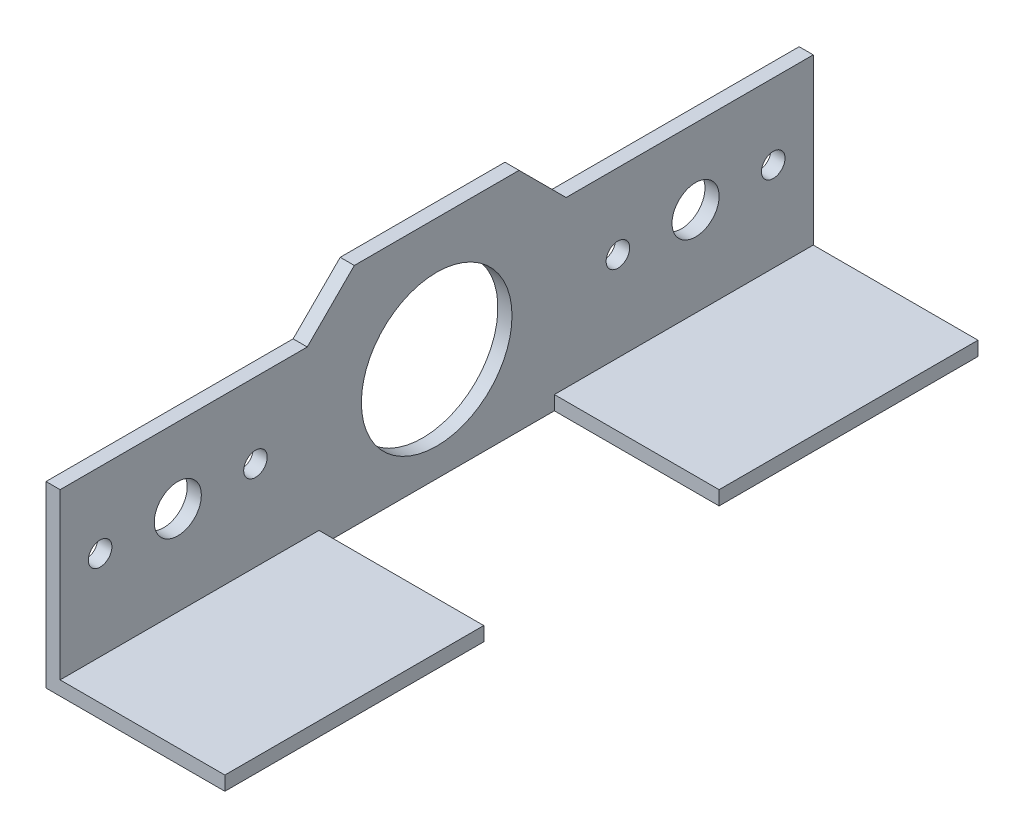
ISO-10303-21;
HEADER;
FILE_DESCRIPTION(('STEP AP214'),'2;1');
FILE_NAME('part.step','',(''),(''),'','','');
FILE_SCHEMA(('AUTOMOTIVE_DESIGN { 1 0 10303 214 1 1 1 1 }'));
ENDSEC;
DATA;
#1=APPLICATION_CONTEXT('core data for automotive mechanical design processes');
#2=APPLICATION_PROTOCOL_DEFINITION('international standard','automotive_design',2000,#1);
#3=PRODUCT_CONTEXT('',#1,'mechanical');
#4=PRODUCT('Part','Part','',(#3));
#5=PRODUCT_RELATED_PRODUCT_CATEGORY('part','',(#4));
#6=PRODUCT_DEFINITION_FORMATION('','',#4);
#7=PRODUCT_DEFINITION_CONTEXT('part definition',#1,'design');
#8=PRODUCT_DEFINITION('design','',#6,#7);
#9=PRODUCT_DEFINITION_SHAPE('','',#8);
#10=(LENGTH_UNIT() NAMED_UNIT(*) SI_UNIT(.MILLI.,.METRE.));
#11=(NAMED_UNIT(*) PLANE_ANGLE_UNIT() SI_UNIT($,.RADIAN.));
#12=(NAMED_UNIT(*) SI_UNIT($,.STERADIAN.) SOLID_ANGLE_UNIT());
#13=UNCERTAINTY_MEASURE_WITH_UNIT(LENGTH_MEASURE(1.E-05),#10,'distance_accuracy_value','');
#14=(GEOMETRIC_REPRESENTATION_CONTEXT(3) GLOBAL_UNCERTAINTY_ASSIGNED_CONTEXT((#13)) GLOBAL_UNIT_ASSIGNED_CONTEXT((#10,
#11,#12)) REPRESENTATION_CONTEXT('',''));
#15=CARTESIAN_POINT('',(0.,0.,0.));
#16=DIRECTION('',(0.,0.,1.));
#17=DIRECTION('',(1.,0.,0.));
#18=AXIS2_PLACEMENT_3D('',#15,#16,#17);
#19=CARTESIAN_POINT('',(0.,38.0000000000002,-80.));
#20=DIRECTION('',(0.,1.00000000000001,0.));
#21=DIRECTION('',(0.,0.,1.));
#22=AXIS2_PLACEMENT_3D('',#19,#20,#21);
#23=PLANE('',#22);
#24=DIRECTION('',(0.,0.,1.));
#25=VECTOR('',#24,1.);
#26=CARTESIAN_POINT('',(3.,38.0000000000002,-79.9999999999999));
#27=LINE('',#26,#25);
#28=CARTESIAN_POINT('',(2.99999999999878,38.0000000000002,27.4999999999995));
#29=VERTEX_POINT('',#28);
#30=CARTESIAN_POINT('',(2.99999999999989,38.0000000000002,80.));
#31=VERTEX_POINT('',#30);
#32=EDGE_CURVE('E276',#29,#31,#27,.T.);
#33=ORIENTED_EDGE('',*,*,#32,.F.);
#34=DIRECTION('',(-1.00000000000001,0.,0.));
#35=VECTOR('',#34,1.);
#36=CARTESIAN_POINT('',(58.9016994374935,38.0000000000002,27.4999999999995));
#37=LINE('',#36,#35);
#38=CARTESIAN_POINT('',(-1.33226762955019E-12,38.0000000000002,27.4999999999998));
#39=VERTEX_POINT('',#38);
#40=EDGE_CURVE('E163',#29,#39,#37,.T.);
#41=ORIENTED_EDGE('',*,*,#40,.T.);
#42=DIRECTION('',(0.,0.,1.));
#43=VECTOR('',#42,1.);
#44=CARTESIAN_POINT('',(0.,38.0000000000002,-80.));
#45=LINE('',#44,#43);
#46=CARTESIAN_POINT('',(0.,38.0000000000002,80.));
#47=VERTEX_POINT('',#46);
#48=EDGE_CURVE('E273',#39,#47,#45,.T.);
#49=ORIENTED_EDGE('',*,*,#48,.T.);
#50=DIRECTION('',(-1.00000000000001,0.,0.));
#51=VECTOR('',#50,1.);
#52=CARTESIAN_POINT('',(0.,38.0000000000002,80.));
#53=LINE('',#52,#51);
#54=EDGE_CURVE('E246',#31,#47,#53,.T.);
#55=ORIENTED_EDGE('',*,*,#54,.F.);
#56=EDGE_LOOP('',(#33,#41,#49,#55));
#57=FACE_BOUND('',#56,.T.);
#58=ADVANCED_FACE('F42',(#57),#23,.T.);
#59=CARTESIAN_POINT('',(3.,3.,-80.));
#60=DIRECTION('',(0.,1.00000000000001,0.));
#61=DIRECTION('',(0.,0.,1.));
#62=AXIS2_PLACEMENT_3D('',#59,#60,#61);
#63=PLANE('',#62);
#64=DIRECTION('',(1.00000000000001,0.,0.));
#65=VECTOR('',#64,1.);
#66=CARTESIAN_POINT('',(2.99999999999878,3.,25.));
#67=LINE('',#66,#65);
#68=CARTESIAN_POINT('',(2.99999999999878,3.,25.));
#69=VERTEX_POINT('',#68);
#70=CARTESIAN_POINT('',(37.9999999999997,3.,24.9999999999997));
#71=VERTEX_POINT('',#70);
#72=EDGE_CURVE('E214',#69,#71,#67,.T.);
#73=ORIENTED_EDGE('',*,*,#72,.F.);
#74=DIRECTION('',(0.,0.,1.));
#75=VECTOR('',#74,1.);
#76=CARTESIAN_POINT('',(3.,3.,-80.));
#77=LINE('',#76,#75);
#78=CARTESIAN_POINT('',(2.99999999999989,3.,80.));
#79=VERTEX_POINT('',#78);
#80=EDGE_CURVE('E279',#69,#79,#77,.T.);
#81=ORIENTED_EDGE('',*,*,#80,.T.);
#82=DIRECTION('',(-1.00000000000001,0.,0.));
#83=VECTOR('',#82,1.);
#84=CARTESIAN_POINT('',(2.99999999999989,3.,80.));
#85=LINE('',#84,#83);
#86=CARTESIAN_POINT('',(37.9999999999999,3.,80.));
#87=VERTEX_POINT('',#86);
#88=EDGE_CURVE('E240',#87,#79,#85,.T.);
#89=ORIENTED_EDGE('',*,*,#88,.F.);
#90=DIRECTION('',(0.,0.,1.));
#91=VECTOR('',#90,1.);
#92=CARTESIAN_POINT('',(38.,3.,-80.));
#93=LINE('',#92,#91);
#94=EDGE_CURVE('E282',#71,#87,#93,.T.);
#95=ORIENTED_EDGE('',*,*,#94,.F.);
#96=EDGE_LOOP('',(#73,#81,#89,#95));
#97=FACE_BOUND('',#96,.T.);
#98=ADVANCED_FACE('F360',(#97),#63,.T.);
#99=CARTESIAN_POINT('',(38.,3.,-80.));
#100=DIRECTION('',(1.00000000000001,0.,0.));
#101=DIRECTION('',(0.,0.,-1.));
#102=AXIS2_PLACEMENT_3D('',#99,#100,#101);
#103=PLANE('',#102);
#104=DIRECTION('',(0.,1.00000000000001,0.));
#105=VECTOR('',#104,1.);
#106=CARTESIAN_POINT('',(37.9999999999997,-61.0327780786688,24.9999999999997));
#107=LINE('',#106,#105);
#108=CARTESIAN_POINT('',(37.9999999999997,0.,25.));
#109=VERTEX_POINT('',#108);
#110=EDGE_CURVE('E228',#109,#71,#107,.T.);
#111=ORIENTED_EDGE('',*,*,#110,.T.);
#112=ORIENTED_EDGE('',*,*,#94,.T.);
#113=DIRECTION('',(0.,1.00000000000001,0.));
#114=VECTOR('',#113,1.);
#115=CARTESIAN_POINT('',(37.9999999999999,3.,80.));
#116=LINE('',#115,#114);
#117=CARTESIAN_POINT('',(37.9999999999999,0.,80.));
#118=VERTEX_POINT('',#117);
#119=EDGE_CURVE('E237',#118,#87,#116,.T.);
#120=ORIENTED_EDGE('',*,*,#119,.F.);
#121=DIRECTION('',(0.,0.,1.));
#122=VECTOR('',#121,1.);
#123=CARTESIAN_POINT('',(38.,0.,-80.0000000000001));
#124=LINE('',#123,#122);
#125=EDGE_CURVE('E269',#109,#118,#124,.T.);
#126=ORIENTED_EDGE('',*,*,#125,.F.);
#127=EDGE_LOOP('',(#111,#112,#120,#126));
#128=FACE_BOUND('',#127,.T.);
#129=ADVANCED_FACE('F291',(#128),#103,.T.);
#130=CARTESIAN_POINT('',(0.,0.,-80.0000000000006));
#131=DIRECTION('',(0.,-1.00000000000001,0.));
#132=DIRECTION('',(0.,0.,-1.));
#133=AXIS2_PLACEMENT_3D('',#130,#131,#132);
#134=PLANE('',#133);
#135=DIRECTION('',(1.00000000000001,0.,0.));
#136=VECTOR('',#135,1.);
#137=CARTESIAN_POINT('',(2.99999999999878,0.,25.));
#138=LINE('',#137,#136);
#139=CARTESIAN_POINT('',(2.99999999999878,0.,25.));
#140=VERTEX_POINT('',#139);
#141=EDGE_CURVE('E225',#140,#109,#138,.T.);
#142=ORIENTED_EDGE('',*,*,#141,.T.);
#143=ORIENTED_EDGE('',*,*,#125,.T.);
#144=DIRECTION('',(1.00000000000001,0.,0.));
#145=VECTOR('',#144,1.);
#146=CARTESIAN_POINT('',(0.,0.,80.));
#147=LINE('',#146,#145);
#148=CARTESIAN_POINT('',(0.,0.,80.));
#149=VERTEX_POINT('',#148);
#150=EDGE_CURVE('E234',#149,#118,#147,.T.);
#151=ORIENTED_EDGE('',*,*,#150,.F.);
#152=DIRECTION('',(0.,0.,1.));
#153=VECTOR('',#152,1.);
#154=CARTESIAN_POINT('',(0.,0.,-80.0000000000006));
#155=LINE('',#154,#153);
#156=CARTESIAN_POINT('',(0.,0.,-80.0000000000006));
#157=VERTEX_POINT('',#156);
#158=EDGE_CURVE('E11',#157,#149,#155,.T.);
#159=ORIENTED_EDGE('',*,*,#158,.F.);
#160=DIRECTION('',(1.00000000000001,0.,0.));
#161=VECTOR('',#160,1.);
#162=CARTESIAN_POINT('',(0.,0.,-80.0000000000006));
#163=LINE('',#162,#161);
#164=CARTESIAN_POINT('',(38.,0.,-80.0000000000001));
#165=VERTEX_POINT('',#164);
#166=EDGE_CURVE('E252',#157,#165,#163,.T.);
#167=ORIENTED_EDGE('',*,*,#166,.T.);
#168=CARTESIAN_POINT('',(37.9999999999998,0.,-25.));
#169=VERTEX_POINT('',#168);
#170=EDGE_CURVE('E46',#165,#169,#124,.T.);
#171=ORIENTED_EDGE('',*,*,#170,.T.);
#172=DIRECTION('',(-1.00000000000001,0.,0.));
#173=VECTOR('',#172,1.);
#174=CARTESIAN_POINT('',(2.99999999999978,0.,-25.0000000000006));
#175=LINE('',#174,#173);
#176=CARTESIAN_POINT('',(2.99999999999978,0.,-25.0000000000006));
#177=VERTEX_POINT('',#176);
#178=EDGE_CURVE('E67',#169,#177,#175,.T.);
#179=ORIENTED_EDGE('',*,*,#178,.T.);
#180=DIRECTION('',(0.,0.,1.));
#181=VECTOR('',#180,1.);
#182=CARTESIAN_POINT('',(2.99999999999978,0.,-25.0000000000006));
#183=LINE('',#182,#181);
#184=EDGE_CURVE('E216',#177,#140,#183,.T.);
#185=ORIENTED_EDGE('',*,*,#184,.T.);
#186=EDGE_LOOP('',(#142,#143,#151,#159,#167,#171,#179,#185));
#187=FACE_BOUND('',#186,.T.);
#188=ADVANCED_FACE('F44',(#187),#134,.T.);
#189=CARTESIAN_POINT('',(0.,0.,-80.0000000000006));
#190=DIRECTION('',(-1.00000000000001,0.,0.));
#191=DIRECTION('',(0.,0.,1.));
#192=AXIS2_PLACEMENT_3D('',#189,#190,#191);
#193=PLANE('',#192);
#194=CARTESIAN_POINT('',(0.,22.0000000000001,-1.94289029309402E-13));
#195=DIRECTION('',(-1.00000000000001,0.,0.));
#196=DIRECTION('',(0.,0.,1.));
#197=AXIS2_PLACEMENT_3D('',#194,#195,#196);
#198=CIRCLE('',#197,15.999999999999);
#199=CARTESIAN_POINT('',(0.,22.0000000000001,15.9999999999988));
#200=VERTEX_POINT('',#199);
#201=EDGE_CURVE('E323',#200,#200,#198,.T.);
#202=ORIENTED_EDGE('',*,*,#201,.F.);
#203=EDGE_LOOP('',(#202));
#204=FACE_BOUND('',#203,.T.);
#205=CARTESIAN_POINT('',(0.,22.0000000000001,71.4999999999998));
#206=DIRECTION('',(-1.00000000000001,0.,0.));
#207=DIRECTION('',(0.,0.,1.));
#208=AXIS2_PLACEMENT_3D('',#205,#206,#207);
#209=CIRCLE('',#208,2.49999999999937);
#210=CARTESIAN_POINT('',(0.,22.0000000000001,73.9999999999992));
#211=VERTEX_POINT('',#210);
#212=EDGE_CURVE('E178',#211,#211,#209,.T.);
#213=ORIENTED_EDGE('',*,*,#212,.F.);
#214=EDGE_LOOP('',(#213));
#215=FACE_BOUND('',#214,.T.);
#216=CARTESIAN_POINT('',(0.,22.0000000000001,54.9999999999998));
#217=DIRECTION('',(-1.00000000000001,0.,0.));
#218=DIRECTION('',(0.,0.,1.));
#219=AXIS2_PLACEMENT_3D('',#216,#217,#218);
#220=CIRCLE('',#219,4.9999999999993);
#221=CARTESIAN_POINT('',(0.,22.0000000000001,59.9999999999991));
#222=VERTEX_POINT('',#221);
#223=EDGE_CURVE('E186',#222,#222,#220,.T.);
#224=ORIENTED_EDGE('',*,*,#223,.F.);
#225=EDGE_LOOP('',(#224));
#226=FACE_BOUND('',#225,.T.);
#227=CARTESIAN_POINT('',(0.,22.0000000000001,38.4999999999998));
#228=DIRECTION('',(-1.00000000000001,0.,0.));
#229=DIRECTION('',(0.,0.,1.));
#230=AXIS2_PLACEMENT_3D('',#227,#228,#229);
#231=CIRCLE('',#230,2.4999999999992);
#232=CARTESIAN_POINT('',(0.,22.0000000000001,40.999999999999));
#233=VERTEX_POINT('',#232);
#234=EDGE_CURVE('E192',#233,#233,#231,.T.);
#235=ORIENTED_EDGE('',*,*,#234,.F.);
#236=EDGE_LOOP('',(#235));
#237=FACE_BOUND('',#236,.T.);
#238=CARTESIAN_POINT('',(-1.33226762955019E-12,22.0000000000001,-38.5000000000001));
#239=DIRECTION('',(-1.00000000000001,0.,0.));
#240=DIRECTION('',(0.,0.,1.));
#241=AXIS2_PLACEMENT_3D('',#238,#239,#240);
#242=CIRCLE('',#241,2.49999999999868);
#243=CARTESIAN_POINT('',(-1.33226762954115E-12,22.0000000000001,-36.0000000000014));
#244=VERTEX_POINT('',#243);
#245=EDGE_CURVE('E198',#244,#244,#242,.T.);
#246=ORIENTED_EDGE('',*,*,#245,.F.);
#247=EDGE_LOOP('',(#246));
#248=FACE_BOUND('',#247,.T.);
#249=CARTESIAN_POINT('',(-1.33226762955019E-12,22.0000000000001,-55.0000000000001));
#250=DIRECTION('',(-1.00000000000001,0.,0.));
#251=DIRECTION('',(0.,0.,1.));
#252=AXIS2_PLACEMENT_3D('',#249,#250,#251);
#253=CIRCLE('',#252,4.99999999999858);
#254=CARTESIAN_POINT('',(-1.3322676295321E-12,22.0000000000001,-50.0000000000015));
#255=VERTEX_POINT('',#254);
#256=EDGE_CURVE('E204',#255,#255,#253,.T.);
#257=ORIENTED_EDGE('',*,*,#256,.F.);
#258=EDGE_LOOP('',(#257));
#259=FACE_BOUND('',#258,.T.);
#260=CARTESIAN_POINT('',(-1.33226762955019E-12,22.0000000000001,-71.5000000000001));
#261=DIRECTION('',(-1.00000000000001,0.,0.));
#262=DIRECTION('',(0.,0.,1.));
#263=AXIS2_PLACEMENT_3D('',#260,#261,#262);
#264=CIRCLE('',#263,2.49999999999852);
#265=CARTESIAN_POINT('',(-1.33226762954115E-12,22.0000000000001,-69.0000000000016));
#266=VERTEX_POINT('',#265);
#267=EDGE_CURVE('E177',#266,#266,#264,.T.);
#268=ORIENTED_EDGE('',*,*,#267,.F.);
#269=EDGE_LOOP('',(#268));
#270=FACE_BOUND('',#269,.T.);
#271=ORIENTED_EDGE('',*,*,#158,.T.);
#272=DIRECTION('',(0.,-1.00000000000001,0.));
#273=VECTOR('',#272,1.);
#274=CARTESIAN_POINT('',(0.,0.,80.));
#275=LINE('',#274,#273);
#276=EDGE_CURVE('E249',#47,#149,#275,.T.);
#277=ORIENTED_EDGE('',*,*,#276,.F.);
#278=ORIENTED_EDGE('',*,*,#48,.F.);
#279=DIRECTION('',(0.,0.707106781186557,-0.707106781186541));
#280=VECTOR('',#279,1.);
#281=CARTESIAN_POINT('',(-1.33226762955019E-12,38.0000000000002,27.4999999999998));
#282=LINE('',#281,#280);
#283=CARTESIAN_POINT('',(0.,48.0000000000003,17.4999999999997));
#284=VERTEX_POINT('',#283);
#285=EDGE_CURVE('E59',#39,#284,#282,.T.);
#286=ORIENTED_EDGE('',*,*,#285,.T.);
#287=DIRECTION('',(0.,0.,-1.));
#288=VECTOR('',#287,1.);
#289=CARTESIAN_POINT('',(-1.33226762955019E-12,48.0000000000003,-17.5000000000006));
#290=LINE('',#289,#288);
#291=CARTESIAN_POINT('',(-1.33226762955019E-12,48.0000000000003,-17.5000000000006));
#292=VERTEX_POINT('',#291);
#293=EDGE_CURVE('E160',#284,#292,#290,.T.);
#294=ORIENTED_EDGE('',*,*,#293,.T.);
#295=DIRECTION('',(0.,-0.70710678118655,-0.707106781186548));
#296=VECTOR('',#295,1.);
#297=CARTESIAN_POINT('',(-1.33226762955019E-12,48.0000000000003,-17.5000000000006));
#298=LINE('',#297,#296);
#299=CARTESIAN_POINT('',(0.,38.0000000000002,-27.5000000000001));
#300=VERTEX_POINT('',#299);
#301=EDGE_CURVE('E165',#292,#300,#298,.T.);
#302=ORIENTED_EDGE('',*,*,#301,.T.);
#303=CARTESIAN_POINT('',(0.,38.0000000000002,-80.));
#304=VERTEX_POINT('',#303);
#305=EDGE_CURVE('E51',#304,#300,#45,.T.);
#306=ORIENTED_EDGE('',*,*,#305,.F.);
#307=DIRECTION('',(0.,-1.00000000000001,0.));
#308=VECTOR('',#307,1.);
#309=CARTESIAN_POINT('',(0.,0.,-80.0000000000006));
#310=LINE('',#309,#308);
#311=EDGE_CURVE('E267',#304,#157,#310,.T.);
#312=ORIENTED_EDGE('',*,*,#311,.T.);
#313=EDGE_LOOP('',(#271,#277,#278,#286,#294,#302,#306,#312));
#314=FACE_BOUND('',#313,.T.);
#315=ADVANCED_FACE('F299',(#204,#215,#226,#237,#248,#259,#270,#314),#193,.T.);
#316=DIRECTION('',(-1.00000000000001,0.,0.));
#317=VECTOR('',#316,1.);
#318=CARTESIAN_POINT('',(58.9016994374946,38.0000000000002,-27.4999999999999));
#319=LINE('',#318,#317);
#320=CARTESIAN_POINT('',(2.99999999999989,38.0000000000002,-27.4999999999999));
#321=VERTEX_POINT('',#320);
#322=EDGE_CURVE('E172',#321,#300,#319,.T.);
#323=ORIENTED_EDGE('',*,*,#322,.F.);
#324=CARTESIAN_POINT('',(3.,38.0000000000002,-79.9999999999999));
#325=VERTEX_POINT('',#324);
#326=EDGE_CURVE('E274',#325,#321,#27,.T.);
#327=ORIENTED_EDGE('',*,*,#326,.F.);
#328=DIRECTION('',(-1.00000000000001,0.,0.));
#329=VECTOR('',#328,1.);
#330=CARTESIAN_POINT('',(0.,38.0000000000002,-80.));
#331=LINE('',#330,#329);
#332=EDGE_CURVE('E264',#325,#304,#331,.T.);
#333=ORIENTED_EDGE('',*,*,#332,.T.);
#334=ORIENTED_EDGE('',*,*,#305,.T.);
#335=EDGE_LOOP('',(#323,#327,#333,#334));
#336=FACE_BOUND('',#335,.T.);
#337=ADVANCED_FACE('F315',(#336),#23,.T.);
#338=CARTESIAN_POINT('',(3.,3.,-80.));
#339=DIRECTION('',(1.00000000000001,0.,0.));
#340=DIRECTION('',(0.,0.,-1.));
#341=AXIS2_PLACEMENT_3D('',#338,#339,#340);
#342=PLANE('',#341);
#343=CARTESIAN_POINT('',(3.,22.0000000000001,-5.27355936696949E-13));
#344=DIRECTION('',(1.00000000000001,0.,0.));
#345=DIRECTION('',(0.,0.,-1.));
#346=AXIS2_PLACEMENT_3D('',#343,#344,#345);
#347=CIRCLE('',#346,15.999999999999);
#348=CARTESIAN_POINT('',(3.,22.0000000000001,-15.9999999999995));
#349=VERTEX_POINT('',#348);
#350=EDGE_CURVE('E319',#349,#349,#347,.F.);
#351=ORIENTED_EDGE('',*,*,#350,.T.);
#352=EDGE_LOOP('',(#351));
#353=FACE_BOUND('',#352,.T.);
#354=CARTESIAN_POINT('',(2.99999999999978,22.0000000000001,71.4999999999998));
#355=DIRECTION('',(1.00000000000001,0.,0.));
#356=DIRECTION('',(0.,0.,-1.));
#357=AXIS2_PLACEMENT_3D('',#354,#355,#356);
#358=CIRCLE('',#357,2.49999999999937);
#359=CARTESIAN_POINT('',(2.99999999999978,22.0000000000001,69.0000000000004));
#360=VERTEX_POINT('',#359);
#361=EDGE_CURVE('E181',#360,#360,#358,.F.);
#362=ORIENTED_EDGE('',*,*,#361,.T.);
#363=EDGE_LOOP('',(#362));
#364=FACE_BOUND('',#363,.T.);
#365=CARTESIAN_POINT('',(2.99999999999989,22.0000000000001,54.9999999999995));
#366=DIRECTION('',(1.00000000000001,0.,0.));
#367=DIRECTION('',(0.,0.,-1.));
#368=AXIS2_PLACEMENT_3D('',#365,#366,#367);
#369=CIRCLE('',#368,4.9999999999993);
#370=CARTESIAN_POINT('',(2.99999999999989,22.0000000000001,50.0000000000002));
#371=VERTEX_POINT('',#370);
#372=EDGE_CURVE('E182',#371,#371,#369,.F.);
#373=ORIENTED_EDGE('',*,*,#372,.T.);
#374=EDGE_LOOP('',(#373));
#375=FACE_BOUND('',#374,.T.);
#376=CARTESIAN_POINT('',(2.99999999999989,22.0000000000001,38.4999999999995));
#377=DIRECTION('',(1.00000000000001,0.,0.));
#378=DIRECTION('',(0.,0.,-1.));
#379=AXIS2_PLACEMENT_3D('',#376,#377,#378);
#380=CIRCLE('',#379,2.4999999999992);
#381=CARTESIAN_POINT('',(2.99999999999989,22.0000000000001,36.0000000000003));
#382=VERTEX_POINT('',#381);
#383=EDGE_CURVE('E189',#382,#382,#380,.F.);
#384=ORIENTED_EDGE('',*,*,#383,.T.);
#385=EDGE_LOOP('',(#384));
#386=FACE_BOUND('',#385,.T.);
#387=CARTESIAN_POINT('',(2.99999999999878,22.0000000000001,-38.5));
#388=DIRECTION('',(1.00000000000001,0.,0.));
#389=DIRECTION('',(0.,0.,-1.));
#390=AXIS2_PLACEMENT_3D('',#387,#388,#389);
#391=CIRCLE('',#390,2.49999999999868);
#392=CARTESIAN_POINT('',(2.99999999999878,22.0000000000001,-40.9999999999986));
#393=VERTEX_POINT('',#392);
#394=EDGE_CURVE('E195',#393,#393,#391,.F.);
#395=ORIENTED_EDGE('',*,*,#394,.T.);
#396=EDGE_LOOP('',(#395));
#397=FACE_BOUND('',#396,.T.);
#398=CARTESIAN_POINT('',(2.99999999999878,22.0000000000001,-55.));
#399=DIRECTION('',(1.00000000000001,0.,0.));
#400=DIRECTION('',(0.,0.,-1.));
#401=AXIS2_PLACEMENT_3D('',#398,#399,#400);
#402=CIRCLE('',#401,4.99999999999858);
#403=CARTESIAN_POINT('',(2.99999999999878,22.0000000000001,-59.9999999999986));
#404=VERTEX_POINT('',#403);
#405=EDGE_CURVE('E201',#404,#404,#402,.F.);
#406=ORIENTED_EDGE('',*,*,#405,.T.);
#407=EDGE_LOOP('',(#406));
#408=FACE_BOUND('',#407,.T.);
#409=CARTESIAN_POINT('',(2.99999999999978,22.0000000000001,-71.5));
#410=DIRECTION('',(1.00000000000001,0.,0.));
#411=DIRECTION('',(0.,0.,-1.));
#412=AXIS2_PLACEMENT_3D('',#409,#410,#411);
#413=CIRCLE('',#412,2.49999999999852);
#414=CARTESIAN_POINT('',(2.99999999999978,22.0000000000001,-73.9999999999985));
#415=VERTEX_POINT('',#414);
#416=EDGE_CURVE('E207',#415,#415,#413,.F.);
#417=ORIENTED_EDGE('',*,*,#416,.T.);
#418=EDGE_LOOP('',(#417));
#419=FACE_BOUND('',#418,.T.);
#420=ORIENTED_EDGE('',*,*,#326,.T.);
#421=DIRECTION('',(0.,-0.70710678118655,-0.707106781186548));
#422=VECTOR('',#421,1.);
#423=CARTESIAN_POINT('',(2.99999999999878,48.0000000000003,-17.5000000000006));
#424=LINE('',#423,#422);
#425=CARTESIAN_POINT('',(2.99999999999878,48.0000000000003,-17.5000000000006));
#426=VERTEX_POINT('',#425);
#427=EDGE_CURVE('E151',#426,#321,#424,.T.);
#428=ORIENTED_EDGE('',*,*,#427,.F.);
#429=DIRECTION('',(0.,0.,-1.));
#430=VECTOR('',#429,1.);
#431=CARTESIAN_POINT('',(2.99999999999878,48.0000000000003,-17.5000000000006));
#432=LINE('',#431,#430);
#433=CARTESIAN_POINT('',(2.99999999999989,48.0000000000003,17.4999999999997));
#434=VERTEX_POINT('',#433);
#435=EDGE_CURVE('E145',#434,#426,#432,.T.);
#436=ORIENTED_EDGE('',*,*,#435,.F.);
#437=DIRECTION('',(0.,0.707106781186557,-0.707106781186541));
#438=VECTOR('',#437,1.);
#439=CARTESIAN_POINT('',(2.99999999999878,38.0000000000002,27.4999999999995));
#440=LINE('',#439,#438);
#441=EDGE_CURVE('E150',#29,#434,#440,.T.);
#442=ORIENTED_EDGE('',*,*,#441,.F.);
#443=ORIENTED_EDGE('',*,*,#32,.T.);
#444=DIRECTION('',(0.,1.00000000000001,0.));
#445=VECTOR('',#444,1.);
#446=CARTESIAN_POINT('',(2.99999999999989,3.,80.));
#447=LINE('',#446,#445);
#448=EDGE_CURVE('E243',#79,#31,#447,.T.);
#449=ORIENTED_EDGE('',*,*,#448,.F.);
#450=ORIENTED_EDGE('',*,*,#80,.F.);
#451=DIRECTION('',(0.,1.00000000000001,0.));
#452=VECTOR('',#451,1.);
#453=CARTESIAN_POINT('',(2.99999999999878,-61.0327780786688,24.9999999999997));
#454=LINE('',#453,#452);
#455=EDGE_CURVE('E221',#140,#69,#454,.T.);
#456=ORIENTED_EDGE('',*,*,#455,.F.);
#457=ORIENTED_EDGE('',*,*,#184,.F.);
#458=DIRECTION('',(0.,1.00000000000001,0.));
#459=VECTOR('',#458,1.);
#460=CARTESIAN_POINT('',(2.99999999999978,-61.0327780786689,-25.));
#461=LINE('',#460,#459);
#462=CARTESIAN_POINT('',(2.99999999999978,3.00000000000004,-25.));
#463=VERTEX_POINT('',#462);
#464=EDGE_CURVE('E223',#177,#463,#461,.T.);
#465=ORIENTED_EDGE('',*,*,#464,.T.);
#466=CARTESIAN_POINT('',(3.,3.,-80.));
#467=VERTEX_POINT('',#466);
#468=EDGE_CURVE('E277',#467,#463,#77,.T.);
#469=ORIENTED_EDGE('',*,*,#468,.F.);
#470=DIRECTION('',(0.,1.00000000000001,0.));
#471=VECTOR('',#470,1.);
#472=CARTESIAN_POINT('',(3.,3.,-80.));
#473=LINE('',#472,#471);
#474=EDGE_CURVE('E261',#467,#325,#473,.T.);
#475=ORIENTED_EDGE('',*,*,#474,.T.);
#476=EDGE_LOOP('',(#420,#428,#436,#442,#443,#449,#450,#456,#457,#465,#469,#475));
#477=FACE_BOUND('',#476,.T.);
#478=ADVANCED_FACE('F148',(#353,#364,#375,#386,#397,#408,#419,#477),#342,.T.);
#479=DIRECTION('',(-1.00000000000001,0.,0.));
#480=VECTOR('',#479,1.);
#481=CARTESIAN_POINT('',(2.99999999999978,3.00000000000004,-25.));
#482=LINE('',#481,#480);
#483=CARTESIAN_POINT('',(37.9999999999998,3.00000000000004,-25.));
#484=VERTEX_POINT('',#483);
#485=EDGE_CURVE('E185',#484,#463,#482,.T.);
#486=ORIENTED_EDGE('',*,*,#485,.F.);
#487=CARTESIAN_POINT('',(38.,3.,-80.));
#488=VERTEX_POINT('',#487);
#489=EDGE_CURVE('E280',#488,#484,#93,.T.);
#490=ORIENTED_EDGE('',*,*,#489,.F.);
#491=DIRECTION('',(-1.00000000000001,0.,0.));
#492=VECTOR('',#491,1.);
#493=CARTESIAN_POINT('',(3.,3.,-80.));
#494=LINE('',#493,#492);
#495=EDGE_CURVE('E258',#488,#467,#494,.T.);
#496=ORIENTED_EDGE('',*,*,#495,.T.);
#497=ORIENTED_EDGE('',*,*,#468,.T.);
#498=EDGE_LOOP('',(#486,#490,#496,#497));
#499=FACE_BOUND('',#498,.T.);
#500=ADVANCED_FACE('F312',(#499),#63,.T.);
#501=DIRECTION('',(0.,1.00000000000001,0.));
#502=VECTOR('',#501,1.);
#503=CARTESIAN_POINT('',(37.9999999999998,-61.0327780786689,-25.));
#504=LINE('',#503,#502);
#505=EDGE_CURVE('E224',#169,#484,#504,.T.);
#506=ORIENTED_EDGE('',*,*,#505,.F.);
#507=ORIENTED_EDGE('',*,*,#170,.F.);
#508=DIRECTION('',(0.,1.00000000000001,0.));
#509=VECTOR('',#508,1.);
#510=CARTESIAN_POINT('',(38.,3.,-80.));
#511=LINE('',#510,#509);
#512=EDGE_CURVE('E255',#165,#488,#511,.T.);
#513=ORIENTED_EDGE('',*,*,#512,.T.);
#514=ORIENTED_EDGE('',*,*,#489,.T.);
#515=EDGE_LOOP('',(#506,#507,#513,#514));
#516=FACE_BOUND('',#515,.T.);
#517=ADVANCED_FACE('F308',(#516),#103,.T.);
#518=CARTESIAN_POINT('',(0.,0.,-80.0000000000006));
#519=DIRECTION('',(0.,0.,-1.));
#520=DIRECTION('',(-1.00000000000001,0.,0.));
#521=AXIS2_PLACEMENT_3D('',#518,#519,#520);
#522=PLANE('',#521);
#523=ORIENTED_EDGE('',*,*,#166,.F.);
#524=ORIENTED_EDGE('',*,*,#311,.F.);
#525=ORIENTED_EDGE('',*,*,#332,.F.);
#526=ORIENTED_EDGE('',*,*,#474,.F.);
#527=ORIENTED_EDGE('',*,*,#495,.F.);
#528=ORIENTED_EDGE('',*,*,#512,.F.);
#529=EDGE_LOOP('',(#523,#524,#525,#526,#527,#528));
#530=FACE_BOUND('',#529,.T.);
#531=ADVANCED_FACE('F304',(#530),#522,.T.);
#532=CARTESIAN_POINT('',(0.,0.,80.));
#533=DIRECTION('',(0.,0.,-1.));
#534=DIRECTION('',(-1.00000000000001,0.,0.));
#535=AXIS2_PLACEMENT_3D('',#532,#533,#534);
#536=PLANE('',#535);
#537=ORIENTED_EDGE('',*,*,#150,.T.);
#538=ORIENTED_EDGE('',*,*,#119,.T.);
#539=ORIENTED_EDGE('',*,*,#88,.T.);
#540=ORIENTED_EDGE('',*,*,#448,.T.);
#541=ORIENTED_EDGE('',*,*,#54,.T.);
#542=ORIENTED_EDGE('',*,*,#276,.T.);
#543=EDGE_LOOP('',(#537,#538,#539,#540,#541,#542));
#544=FACE_BOUND('',#543,.T.);
#545=ADVANCED_FACE('F294',(#544),#536,.F.);
#546=CARTESIAN_POINT('',(2.99999999999878,-61.0327780786688,24.9999999999997));
#547=DIRECTION('',(0.,0.,1.));
#548=DIRECTION('',(1.00000000000001,0.,0.));
#549=AXIS2_PLACEMENT_3D('',#546,#547,#548);
#550=PLANE('',#549);
#551=ORIENTED_EDGE('',*,*,#455,.T.);
#552=ORIENTED_EDGE('',*,*,#72,.T.);
#553=ORIENTED_EDGE('',*,*,#110,.F.);
#554=ORIENTED_EDGE('',*,*,#141,.F.);
#555=EDGE_LOOP('',(#551,#552,#553,#554));
#556=FACE_BOUND('',#555,.T.);
#557=ADVANCED_FACE('F374',(#556),#550,.F.);
#558=CARTESIAN_POINT('',(2.99999999999978,-61.0327780786689,-25.));
#559=DIRECTION('',(0.,0.,-1.));
#560=DIRECTION('',(-1.00000000000001,0.,0.));
#561=AXIS2_PLACEMENT_3D('',#558,#559,#560);
#562=PLANE('',#561);
#563=ORIENTED_EDGE('',*,*,#505,.T.);
#564=ORIENTED_EDGE('',*,*,#485,.T.);
#565=ORIENTED_EDGE('',*,*,#464,.F.);
#566=ORIENTED_EDGE('',*,*,#178,.F.);
#567=EDGE_LOOP('',(#563,#564,#565,#566));
#568=FACE_BOUND('',#567,.T.);
#569=ADVANCED_FACE('F310',(#568),#562,.F.);
#570=CARTESIAN_POINT('',(17.1421356237288,22.0000000000001,-71.5000000000001));
#571=DIRECTION('',(-1.00000000000001,0.,0.));
#572=DIRECTION('',(0.,0.,1.));
#573=AXIS2_PLACEMENT_3D('',#570,#571,#572);
#574=CYLINDRICAL_SURFACE('',#573,2.49999999999852);
#575=ORIENTED_EDGE('',*,*,#267,.T.);
#576=EDGE_LOOP('',(#575));
#577=FACE_BOUND('',#576,.T.);
#578=ORIENTED_EDGE('',*,*,#416,.F.);
#579=EDGE_LOOP('',(#578));
#580=FACE_BOUND('',#579,.T.);
#581=ADVANCED_FACE('F345',(#577,#580),#574,.F.);
#582=CARTESIAN_POINT('',(17.1421356237287,22.0000000000001,-55.0000000000001));
#583=DIRECTION('',(-1.00000000000001,0.,0.));
#584=DIRECTION('',(0.,0.,1.));
#585=AXIS2_PLACEMENT_3D('',#582,#583,#584);
#586=CYLINDRICAL_SURFACE('',#585,4.99999999999858);
#587=ORIENTED_EDGE('',*,*,#256,.T.);
#588=EDGE_LOOP('',(#587));
#589=FACE_BOUND('',#588,.T.);
#590=ORIENTED_EDGE('',*,*,#405,.F.);
#591=EDGE_LOOP('',(#590));
#592=FACE_BOUND('',#591,.T.);
#593=ADVANCED_FACE('F348',(#589,#592),#586,.F.);
#594=CARTESIAN_POINT('',(17.1421356237278,22.0000000000001,-38.5000000000001));
#595=DIRECTION('',(-1.00000000000001,0.,0.));
#596=DIRECTION('',(0.,0.,1.));
#597=AXIS2_PLACEMENT_3D('',#594,#595,#596);
#598=CYLINDRICAL_SURFACE('',#597,2.49999999999868);
#599=ORIENTED_EDGE('',*,*,#245,.T.);
#600=EDGE_LOOP('',(#599));
#601=FACE_BOUND('',#600,.T.);
#602=ORIENTED_EDGE('',*,*,#394,.F.);
#603=EDGE_LOOP('',(#602));
#604=FACE_BOUND('',#603,.T.);
#605=ADVANCED_FACE('F382',(#601,#604),#598,.F.);
#606=CARTESIAN_POINT('',(17.1421356237288,22.0000000000001,38.4999999999998));
#607=DIRECTION('',(-1.00000000000001,0.,0.));
#608=DIRECTION('',(0.,0.,1.));
#609=AXIS2_PLACEMENT_3D('',#606,#607,#608);
#610=CYLINDRICAL_SURFACE('',#609,2.4999999999992);
#611=ORIENTED_EDGE('',*,*,#234,.T.);
#612=EDGE_LOOP('',(#611));
#613=FACE_BOUND('',#612,.T.);
#614=ORIENTED_EDGE('',*,*,#383,.F.);
#615=EDGE_LOOP('',(#614));
#616=FACE_BOUND('',#615,.T.);
#617=ADVANCED_FACE('F386',(#613,#616),#610,.F.);
#618=CARTESIAN_POINT('',(17.1421356237288,22.0000000000001,54.9999999999998));
#619=DIRECTION('',(-1.00000000000001,0.,0.));
#620=DIRECTION('',(0.,0.,1.));
#621=AXIS2_PLACEMENT_3D('',#618,#619,#620);
#622=CYLINDRICAL_SURFACE('',#621,4.9999999999993);
#623=ORIENTED_EDGE('',*,*,#223,.T.);
#624=EDGE_LOOP('',(#623));
#625=FACE_BOUND('',#624,.T.);
#626=ORIENTED_EDGE('',*,*,#372,.F.);
#627=EDGE_LOOP('',(#626));
#628=FACE_BOUND('',#627,.T.);
#629=ADVANCED_FACE('F390',(#625,#628),#622,.F.);
#630=CARTESIAN_POINT('',(17.1421356237288,22.0000000000001,71.4999999999998));
#631=DIRECTION('',(-1.00000000000001,0.,0.));
#632=DIRECTION('',(0.,0.,1.));
#633=AXIS2_PLACEMENT_3D('',#630,#631,#632);
#634=CYLINDRICAL_SURFACE('',#633,2.49999999999937);
#635=ORIENTED_EDGE('',*,*,#212,.T.);
#636=EDGE_LOOP('',(#635));
#637=FACE_BOUND('',#636,.T.);
#638=ORIENTED_EDGE('',*,*,#361,.F.);
#639=EDGE_LOOP('',(#638));
#640=FACE_BOUND('',#639,.T.);
#641=ADVANCED_FACE('F394',(#637,#640),#634,.F.);
#642=CARTESIAN_POINT('',(58.9016994374935,38.0000000000002,27.4999999999995));
#643=DIRECTION('',(0.,0.707106781186544,0.707106781186554));
#644=DIRECTION('',(0.,-0.707106781186557,0.707106781186541));
#645=AXIS2_PLACEMENT_3D('',#642,#643,#644);
#646=PLANE('',#645);
#647=ORIENTED_EDGE('',*,*,#40,.F.);
#648=ORIENTED_EDGE('',*,*,#441,.T.);
#649=DIRECTION('',(-1.00000000000001,0.,0.));
#650=VECTOR('',#649,1.);
#651=CARTESIAN_POINT('',(58.9016994374946,48.0000000000003,17.4999999999997));
#652=LINE('',#651,#650);
#653=EDGE_CURVE('E155',#434,#284,#652,.T.);
#654=ORIENTED_EDGE('',*,*,#653,.T.);
#655=ORIENTED_EDGE('',*,*,#285,.F.);
#656=EDGE_LOOP('',(#647,#648,#654,#655));
#657=FACE_BOUND('',#656,.T.);
#658=ADVANCED_FACE('F162',(#657),#646,.T.);
#659=CARTESIAN_POINT('',(58.9016994374933,48.0000000000003,-17.5000000000006));
#660=DIRECTION('',(0.,1.00000000000001,0.));
#661=DIRECTION('',(0.,0.,1.));
#662=AXIS2_PLACEMENT_3D('',#659,#660,#661);
#663=PLANE('',#662);
#664=ORIENTED_EDGE('',*,*,#653,.F.);
#665=ORIENTED_EDGE('',*,*,#435,.T.);
#666=DIRECTION('',(-1.00000000000001,0.,0.));
#667=VECTOR('',#666,1.);
#668=CARTESIAN_POINT('',(58.9016994374933,48.0000000000003,-17.5000000000006));
#669=LINE('',#668,#667);
#670=EDGE_CURVE('E154',#426,#292,#669,.T.);
#671=ORIENTED_EDGE('',*,*,#670,.T.);
#672=ORIENTED_EDGE('',*,*,#293,.F.);
#673=EDGE_LOOP('',(#664,#665,#671,#672));
#674=FACE_BOUND('',#673,.T.);
#675=ADVANCED_FACE('F158',(#674),#663,.T.);
#676=CARTESIAN_POINT('',(58.9016994374933,48.0000000000003,-17.5000000000006));
#677=DIRECTION('',(0.,0.70710678118655,-0.707106781186547));
#678=DIRECTION('',(0.,0.70710678118655,0.707106781186548));
#679=AXIS2_PLACEMENT_3D('',#676,#677,#678);
#680=PLANE('',#679);
#681=ORIENTED_EDGE('',*,*,#670,.F.);
#682=ORIENTED_EDGE('',*,*,#427,.T.);
#683=ORIENTED_EDGE('',*,*,#322,.T.);
#684=ORIENTED_EDGE('',*,*,#301,.F.);
#685=EDGE_LOOP('',(#681,#682,#683,#684));
#686=FACE_BOUND('',#685,.T.);
#687=ADVANCED_FACE('F318',(#686),#680,.T.);
#688=CARTESIAN_POINT('',(48.2548339959362,22.0000000000001,-1.94289029309402E-13));
#689=DIRECTION('',(-1.00000000000001,0.,0.));
#690=DIRECTION('',(0.,0.,1.));
#691=AXIS2_PLACEMENT_3D('',#688,#689,#690);
#692=CYLINDRICAL_SURFACE('',#691,15.999999999999);
#693=ORIENTED_EDGE('',*,*,#201,.T.);
#694=EDGE_LOOP('',(#693));
#695=FACE_BOUND('',#694,.T.);
#696=ORIENTED_EDGE('',*,*,#350,.F.);
#697=EDGE_LOOP('',(#696));
#698=FACE_BOUND('',#697,.T.);
#699=ADVANCED_FACE('F327',(#695,#698),#692,.F.);
#700=CLOSED_SHELL('',(#58,#98,#129,#188,#315,#337,#478,#500,#517,#531,#545,#557,#569,#581,#593,
#605,#617,#629,#641,#658,#675,#687,#699));
#701=MANIFOLD_SOLID_BREP('B2',#700);
#702=ADVANCED_BREP_SHAPE_REPRESENTATION('',(#18,#701),#14);
#703=SHAPE_DEFINITION_REPRESENTATION(#9,#702);
ENDSEC;
END-ISO-10303-21;
